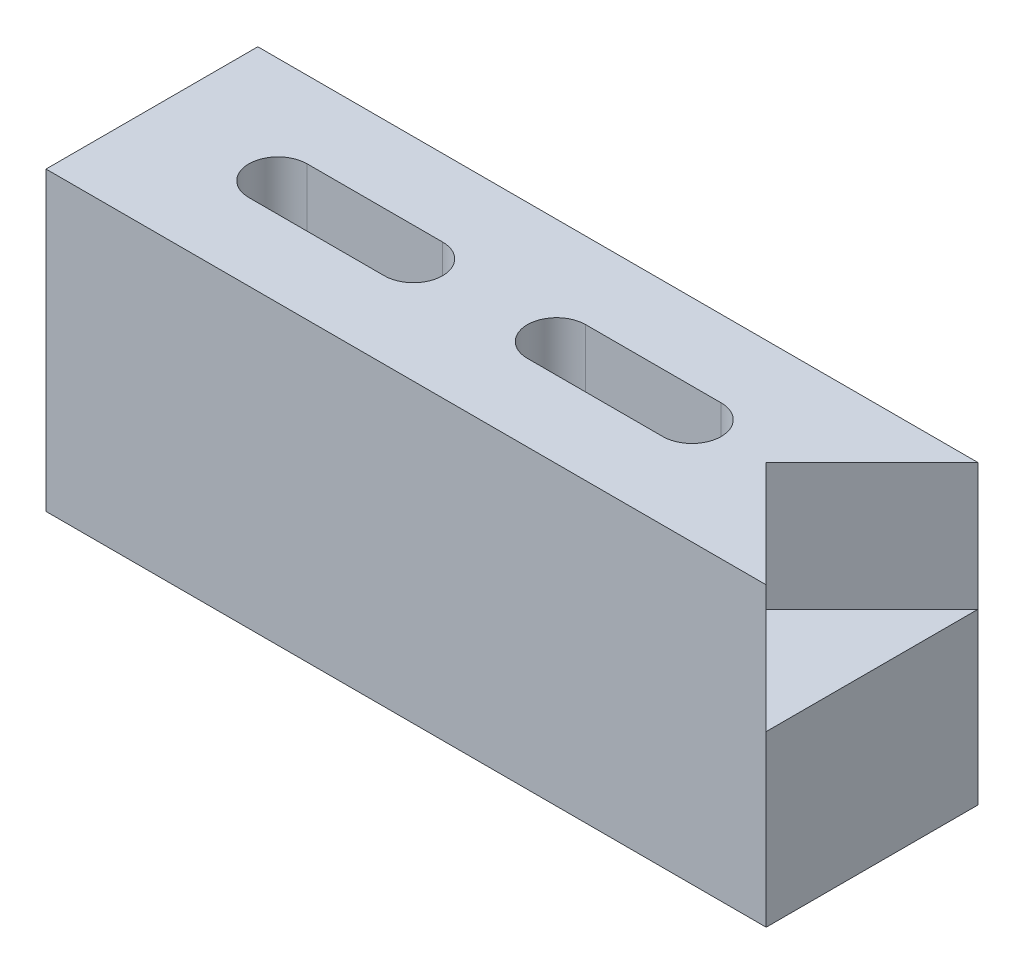
ISO-10303-21;
HEADER;
FILE_DESCRIPTION(('STEP AP214'),'2;1');
FILE_NAME('part.step','',(''),(''),'','','');
FILE_SCHEMA(('AUTOMOTIVE_DESIGN { 1 0 10303 214 1 1 1 1 }'));
ENDSEC;
DATA;
#1=APPLICATION_CONTEXT('core data for automotive mechanical design processes');
#2=APPLICATION_PROTOCOL_DEFINITION('international standard','automotive_design',2000,#1);
#3=PRODUCT_CONTEXT('',#1,'mechanical');
#4=PRODUCT('Part','Part','',(#3));
#5=PRODUCT_RELATED_PRODUCT_CATEGORY('part','',(#4));
#6=PRODUCT_DEFINITION_FORMATION('','',#4);
#7=PRODUCT_DEFINITION_CONTEXT('part definition',#1,'design');
#8=PRODUCT_DEFINITION('design','',#6,#7);
#9=PRODUCT_DEFINITION_SHAPE('','',#8);
#10=(LENGTH_UNIT() NAMED_UNIT(*) SI_UNIT(.MILLI.,.METRE.));
#11=(NAMED_UNIT(*) PLANE_ANGLE_UNIT() SI_UNIT($,.RADIAN.));
#12=(NAMED_UNIT(*) SI_UNIT($,.STERADIAN.) SOLID_ANGLE_UNIT());
#13=UNCERTAINTY_MEASURE_WITH_UNIT(LENGTH_MEASURE(1.E-05),#10,'distance_accuracy_value','');
#14=(GEOMETRIC_REPRESENTATION_CONTEXT(3) GLOBAL_UNCERTAINTY_ASSIGNED_CONTEXT((#13)) GLOBAL_UNIT_ASSIGNED_CONTEXT((#10,
#11,#12)) REPRESENTATION_CONTEXT('',''));
#15=CARTESIAN_POINT('',(0.,0.,0.));
#16=DIRECTION('',(0.,0.,1.));
#17=DIRECTION('',(1.,0.,0.));
#18=AXIS2_PLACEMENT_3D('',#15,#16,#17);
#19=CARTESIAN_POINT('',(43.18,0.,-12.7));
#20=DIRECTION('',(1.,0.,0.));
#21=DIRECTION('',(0.,0.,-1.));
#22=AXIS2_PLACEMENT_3D('',#19,#20,#21);
#23=PLANE('',#22);
#24=DIRECTION('',(0.,1.,0.));
#25=VECTOR('',#24,1.);
#26=CARTESIAN_POINT('',(43.18,0.,-12.7));
#27=LINE('',#26,#25);
#28=CARTESIAN_POINT('',(43.18,0.,-12.7));
#29=VERTEX_POINT('',#28);
#30=CARTESIAN_POINT('',(43.18,10.16,-12.7));
#31=VERTEX_POINT('',#30);
#32=EDGE_CURVE('E235',#29,#31,#27,.T.);
#33=ORIENTED_EDGE('',*,*,#32,.T.);
#34=DIRECTION('',(0.,0.,-1.));
#35=VECTOR('',#34,1.);
#36=CARTESIAN_POINT('',(43.18,10.16,-12.7));
#37=LINE('',#36,#35);
#38=CARTESIAN_POINT('',(43.18,10.16,0.));
#39=VERTEX_POINT('',#38);
#40=EDGE_CURVE('E207',#39,#31,#37,.T.);
#41=ORIENTED_EDGE('',*,*,#40,.F.);
#42=DIRECTION('',(0.,1.,0.));
#43=VECTOR('',#42,1.);
#44=CARTESIAN_POINT('',(43.18,0.,0.));
#45=LINE('',#44,#43);
#46=CARTESIAN_POINT('',(43.18,0.,0.));
#47=VERTEX_POINT('',#46);
#48=EDGE_CURVE('E246',#47,#39,#45,.T.);
#49=ORIENTED_EDGE('',*,*,#48,.F.);
#50=DIRECTION('',(0.,0.,1.));
#51=VECTOR('',#50,1.);
#52=CARTESIAN_POINT('',(43.18,0.,-12.7));
#53=LINE('',#52,#51);
#54=EDGE_CURVE('E44',#29,#47,#53,.T.);
#55=ORIENTED_EDGE('',*,*,#54,.F.);
#56=EDGE_LOOP('',(#33,#41,#49,#55));
#57=FACE_BOUND('',#56,.T.);
#58=ADVANCED_FACE('F35',(#57),#23,.T.);
#59=CARTESIAN_POINT('',(0.,0.,-12.7));
#60=DIRECTION('',(-1.,0.,0.));
#61=DIRECTION('',(0.,0.,1.));
#62=AXIS2_PLACEMENT_3D('',#59,#60,#61);
#63=PLANE('',#62);
#64=DIRECTION('',(0.,-1.,0.));
#65=VECTOR('',#64,1.);
#66=CARTESIAN_POINT('',(0.,0.,0.));
#67=LINE('',#66,#65);
#68=CARTESIAN_POINT('',(0.,17.78,0.));
#69=VERTEX_POINT('',#68);
#70=CARTESIAN_POINT('',(0.,0.,0.));
#71=VERTEX_POINT('',#70);
#72=EDGE_CURVE('E224',#69,#71,#67,.T.);
#73=ORIENTED_EDGE('',*,*,#72,.F.);
#74=DIRECTION('',(0.,0.,1.));
#75=VECTOR('',#74,1.);
#76=CARTESIAN_POINT('',(0.,17.78,-12.7));
#77=LINE('',#76,#75);
#78=CARTESIAN_POINT('',(0.,17.78,-12.7));
#79=VERTEX_POINT('',#78);
#80=EDGE_CURVE('E11',#79,#69,#77,.T.);
#81=ORIENTED_EDGE('',*,*,#80,.F.);
#82=DIRECTION('',(0.,-1.,0.));
#83=VECTOR('',#82,1.);
#84=CARTESIAN_POINT('',(0.,0.,-12.7));
#85=LINE('',#84,#83);
#86=CARTESIAN_POINT('',(0.,0.,-12.7));
#87=VERTEX_POINT('',#86);
#88=EDGE_CURVE('E228',#79,#87,#85,.T.);
#89=ORIENTED_EDGE('',*,*,#88,.T.);
#90=DIRECTION('',(0.,0.,1.));
#91=VECTOR('',#90,1.);
#92=CARTESIAN_POINT('',(0.,0.,-12.7));
#93=LINE('',#92,#91);
#94=EDGE_CURVE('E39',#87,#71,#93,.T.);
#95=ORIENTED_EDGE('',*,*,#94,.T.);
#96=EDGE_LOOP('',(#73,#81,#89,#95));
#97=FACE_BOUND('',#96,.T.);
#98=ADVANCED_FACE('F37',(#97),#63,.T.);
#99=CARTESIAN_POINT('',(0.,17.78,-12.7));
#100=DIRECTION('',(0.,1.,0.));
#101=DIRECTION('',(0.,0.,1.));
#102=AXIS2_PLACEMENT_3D('',#99,#100,#101);
#103=PLANE('',#102);
#104=CARTESIAN_POINT('',(32.381000008,17.78,-6.35));
#105=DIRECTION('',(0.,1.,0.));
#106=DIRECTION('',(0.,0.,1.));
#107=AXIS2_PLACEMENT_3D('',#104,#105,#106);
#108=CIRCLE('',#107,1.750000056);
#109=CARTESIAN_POINT('',(32.381000008,17.78,-4.599999944));
#110=VERTEX_POINT('',#109);
#111=CARTESIAN_POINT('',(32.381000008,17.78,-8.100000056));
#112=VERTEX_POINT('',#111);
#113=EDGE_CURVE('E52',#110,#112,#108,.T.);
#114=ORIENTED_EDGE('',*,*,#113,.F.);
#115=DIRECTION('',(1.,0.,0.));
#116=VECTOR('',#115,1.);
#117=CARTESIAN_POINT('',(32.381000008,17.78,-4.599999944));
#118=LINE('',#117,#116);
#119=CARTESIAN_POINT('',(24.260999992,17.78,-4.599999944));
#120=VERTEX_POINT('',#119);
#121=EDGE_CURVE('E158',#120,#110,#118,.T.);
#122=ORIENTED_EDGE('',*,*,#121,.F.);
#123=CARTESIAN_POINT('',(24.260999992,17.78,-6.35));
#124=DIRECTION('',(0.,1.,0.));
#125=DIRECTION('',(0.,0.,1.));
#126=AXIS2_PLACEMENT_3D('',#123,#124,#125);
#127=CIRCLE('',#126,1.750000056);
#128=CARTESIAN_POINT('',(24.260999992,17.78,-8.100000056));
#129=VERTEX_POINT('',#128);
#130=EDGE_CURVE('E161',#129,#120,#127,.T.);
#131=ORIENTED_EDGE('',*,*,#130,.F.);
#132=DIRECTION('',(-1.,0.,0.));
#133=VECTOR('',#132,1.);
#134=CARTESIAN_POINT('',(32.381000008,17.78,-8.100000056));
#135=LINE('',#134,#133);
#136=EDGE_CURVE('E167',#112,#129,#135,.T.);
#137=ORIENTED_EDGE('',*,*,#136,.F.);
#138=EDGE_LOOP('',(#114,#122,#131,#137));
#139=FACE_BOUND('',#138,.T.);
#140=CARTESIAN_POINT('',(15.68099988,17.78,-6.35));
#141=DIRECTION('',(0.,1.,0.));
#142=DIRECTION('',(0.,0.,1.));
#143=AXIS2_PLACEMENT_3D('',#140,#141,#142);
#144=CIRCLE('',#143,1.750000056);
#145=CARTESIAN_POINT('',(15.68099988,17.78,-4.599999944));
#146=VERTEX_POINT('',#145);
#147=CARTESIAN_POINT('',(15.68099988,17.78,-8.100000056));
#148=VERTEX_POINT('',#147);
#149=EDGE_CURVE('E60',#146,#148,#144,.T.);
#150=ORIENTED_EDGE('',*,*,#149,.F.);
#151=DIRECTION('',(1.,0.,0.));
#152=VECTOR('',#151,1.);
#153=CARTESIAN_POINT('',(15.68099988,17.78,-4.599999944));
#154=LINE('',#153,#152);
#155=CARTESIAN_POINT('',(7.56099986399997,17.78,-4.599999944));
#156=VERTEX_POINT('',#155);
#157=EDGE_CURVE('E182',#156,#146,#154,.T.);
#158=ORIENTED_EDGE('',*,*,#157,.F.);
#159=CARTESIAN_POINT('',(7.56099986399997,17.78,-6.35));
#160=DIRECTION('',(0.,1.,0.));
#161=DIRECTION('',(0.,0.,1.));
#162=AXIS2_PLACEMENT_3D('',#159,#160,#161);
#163=CIRCLE('',#162,1.750000056);
#164=CARTESIAN_POINT('',(7.56099986399997,17.78,-8.100000056));
#165=VERTEX_POINT('',#164);
#166=EDGE_CURVE('E196',#165,#156,#163,.T.);
#167=ORIENTED_EDGE('',*,*,#166,.F.);
#168=DIRECTION('',(-1.,0.,0.));
#169=VECTOR('',#168,1.);
#170=CARTESIAN_POINT('',(15.68099988,17.78,-8.100000056));
#171=LINE('',#170,#169);
#172=EDGE_CURVE('E193',#148,#165,#171,.T.);
#173=ORIENTED_EDGE('',*,*,#172,.F.);
#174=EDGE_LOOP('',(#150,#158,#167,#173));
#175=FACE_BOUND('',#174,.T.);
#176=DIRECTION('',(0.707106781186549,0.,0.707106781186546));
#177=VECTOR('',#176,1.);
#178=CARTESIAN_POINT('',(36.83,17.78,-6.35));
#179=LINE('',#178,#177);
#180=CARTESIAN_POINT('',(36.83,17.78,-6.35));
#181=VERTEX_POINT('',#180);
#182=CARTESIAN_POINT('',(43.18,17.78,0.));
#183=VERTEX_POINT('',#182);
#184=EDGE_CURVE('E211',#181,#183,#179,.T.);
#185=ORIENTED_EDGE('',*,*,#184,.F.);
#186=DIRECTION('',(-0.707106781186549,0.,0.707106781186546));
#187=VECTOR('',#186,1.);
#188=CARTESIAN_POINT('',(43.18,17.78,-12.7));
#189=LINE('',#188,#187);
#190=CARTESIAN_POINT('',(43.18,17.78,-12.7));
#191=VERTEX_POINT('',#190);
#192=EDGE_CURVE('E174',#191,#181,#189,.T.);
#193=ORIENTED_EDGE('',*,*,#192,.F.);
#194=DIRECTION('',(-1.,0.,0.));
#195=VECTOR('',#194,1.);
#196=CARTESIAN_POINT('',(0.,17.78,-12.7));
#197=LINE('',#196,#195);
#198=EDGE_CURVE('E238',#191,#79,#197,.T.);
#199=ORIENTED_EDGE('',*,*,#198,.T.);
#200=ORIENTED_EDGE('',*,*,#80,.T.);
#201=DIRECTION('',(-1.,0.,0.));
#202=VECTOR('',#201,1.);
#203=CARTESIAN_POINT('',(0.,17.78,0.));
#204=LINE('',#203,#202);
#205=EDGE_CURVE('E232',#183,#69,#204,.T.);
#206=ORIENTED_EDGE('',*,*,#205,.F.);
#207=EDGE_LOOP('',(#185,#193,#199,#200,#206));
#208=FACE_BOUND('',#207,.T.);
#209=ADVANCED_FACE('F262',(#139,#175,#208),#103,.T.);
#210=CARTESIAN_POINT('',(0.,0.,-12.7));
#211=DIRECTION('',(0.,-1.,0.));
#212=DIRECTION('',(0.,0.,-1.));
#213=AXIS2_PLACEMENT_3D('',#210,#211,#212);
#214=PLANE('',#213);
#215=CARTESIAN_POINT('',(32.381000008,0.,-6.35));
#216=DIRECTION('',(0.,1.,0.));
#217=DIRECTION('',(0.,0.,1.));
#218=AXIS2_PLACEMENT_3D('',#215,#216,#217);
#219=CIRCLE('',#218,1.750000056);
#220=CARTESIAN_POINT('',(32.381000008,0.,-4.599999944));
#221=VERTEX_POINT('',#220);
#222=CARTESIAN_POINT('',(32.381000008,0.,-8.100000056));
#223=VERTEX_POINT('',#222);
#224=EDGE_CURVE('E139',#221,#223,#219,.T.);
#225=ORIENTED_EDGE('',*,*,#224,.T.);
#226=DIRECTION('',(-1.,0.,0.));
#227=VECTOR('',#226,1.);
#228=CARTESIAN_POINT('',(32.381000008,0.,-8.100000056));
#229=LINE('',#228,#227);
#230=CARTESIAN_POINT('',(24.260999992,0.,-8.100000056));
#231=VERTEX_POINT('',#230);
#232=EDGE_CURVE('E149',#223,#231,#229,.T.);
#233=ORIENTED_EDGE('',*,*,#232,.T.);
#234=CARTESIAN_POINT('',(24.260999992,0.,-6.35));
#235=DIRECTION('',(0.,1.,0.));
#236=DIRECTION('',(0.,0.,1.));
#237=AXIS2_PLACEMENT_3D('',#234,#235,#236);
#238=CIRCLE('',#237,1.750000056);
#239=CARTESIAN_POINT('',(24.260999992,0.,-4.599999944));
#240=VERTEX_POINT('',#239);
#241=EDGE_CURVE('E153',#231,#240,#238,.T.);
#242=ORIENTED_EDGE('',*,*,#241,.T.);
#243=DIRECTION('',(1.,0.,0.));
#244=VECTOR('',#243,1.);
#245=CARTESIAN_POINT('',(32.381000008,0.,-4.599999944));
#246=LINE('',#245,#244);
#247=EDGE_CURVE('E145',#240,#221,#246,.T.);
#248=ORIENTED_EDGE('',*,*,#247,.T.);
#249=EDGE_LOOP('',(#225,#233,#242,#248));
#250=FACE_BOUND('',#249,.T.);
#251=CARTESIAN_POINT('',(15.68099988,0.,-6.35));
#252=DIRECTION('',(0.,1.,0.));
#253=DIRECTION('',(0.,0.,1.));
#254=AXIS2_PLACEMENT_3D('',#251,#252,#253);
#255=CIRCLE('',#254,1.750000056);
#256=CARTESIAN_POINT('',(15.68099988,0.,-4.599999944));
#257=VERTEX_POINT('',#256);
#258=CARTESIAN_POINT('',(15.68099988,0.,-8.100000056));
#259=VERTEX_POINT('',#258);
#260=EDGE_CURVE('E178',#257,#259,#255,.T.);
#261=ORIENTED_EDGE('',*,*,#260,.T.);
#262=DIRECTION('',(-1.,0.,0.));
#263=VECTOR('',#262,1.);
#264=CARTESIAN_POINT('',(15.68099988,0.,-8.100000056));
#265=LINE('',#264,#263);
#266=CARTESIAN_POINT('',(7.56099986399997,0.,-8.100000056));
#267=VERTEX_POINT('',#266);
#268=EDGE_CURVE('E181',#259,#267,#265,.T.);
#269=ORIENTED_EDGE('',*,*,#268,.T.);
#270=CARTESIAN_POINT('',(7.56099986399997,0.,-6.35));
#271=DIRECTION('',(0.,1.,0.));
#272=DIRECTION('',(0.,0.,1.));
#273=AXIS2_PLACEMENT_3D('',#270,#271,#272);
#274=CIRCLE('',#273,1.750000056);
#275=CARTESIAN_POINT('',(7.56099986399997,0.,-4.599999944));
#276=VERTEX_POINT('',#275);
#277=EDGE_CURVE('E185',#267,#276,#274,.T.);
#278=ORIENTED_EDGE('',*,*,#277,.T.);
#279=DIRECTION('',(1.,0.,0.));
#280=VECTOR('',#279,1.);
#281=CARTESIAN_POINT('',(15.68099988,0.,-4.599999944));
#282=LINE('',#281,#280);
#283=EDGE_CURVE('E188',#276,#257,#282,.T.);
#284=ORIENTED_EDGE('',*,*,#283,.T.);
#285=EDGE_LOOP('',(#261,#269,#278,#284));
#286=FACE_BOUND('',#285,.T.);
#287=DIRECTION('',(1.,0.,0.));
#288=VECTOR('',#287,1.);
#289=CARTESIAN_POINT('',(0.,0.,0.));
#290=LINE('',#289,#288);
#291=EDGE_CURVE('E243',#71,#47,#290,.T.);
#292=ORIENTED_EDGE('',*,*,#291,.F.);
#293=ORIENTED_EDGE('',*,*,#94,.F.);
#294=DIRECTION('',(1.,0.,0.));
#295=VECTOR('',#294,1.);
#296=CARTESIAN_POINT('',(0.,0.,-12.7));
#297=LINE('',#296,#295);
#298=EDGE_CURVE('E231',#87,#29,#297,.T.);
#299=ORIENTED_EDGE('',*,*,#298,.T.);
#300=ORIENTED_EDGE('',*,*,#54,.T.);
#301=EDGE_LOOP('',(#292,#293,#299,#300));
#302=FACE_BOUND('',#301,.T.);
#303=ADVANCED_FACE('F155',(#250,#286,#302),#214,.T.);
#304=CARTESIAN_POINT('',(0.,0.,-12.7));
#305=DIRECTION('',(0.,0.,-1.));
#306=DIRECTION('',(-1.,0.,0.));
#307=AXIS2_PLACEMENT_3D('',#304,#305,#306);
#308=PLANE('',#307);
#309=ORIENTED_EDGE('',*,*,#88,.F.);
#310=ORIENTED_EDGE('',*,*,#198,.F.);
#311=DIRECTION('',(0.,1.,0.));
#312=VECTOR('',#311,1.);
#313=CARTESIAN_POINT('',(43.18,10.16,-12.7));
#314=LINE('',#313,#312);
#315=EDGE_CURVE('E217',#31,#191,#314,.T.);
#316=ORIENTED_EDGE('',*,*,#315,.F.);
#317=ORIENTED_EDGE('',*,*,#32,.F.);
#318=ORIENTED_EDGE('',*,*,#298,.F.);
#319=EDGE_LOOP('',(#309,#310,#316,#317,#318));
#320=FACE_BOUND('',#319,.T.);
#321=ADVANCED_FACE('F266',(#320),#308,.T.);
#322=CARTESIAN_POINT('',(0.,0.,0.));
#323=DIRECTION('',(0.,0.,-1.));
#324=DIRECTION('',(-1.,0.,0.));
#325=AXIS2_PLACEMENT_3D('',#322,#323,#324);
#326=PLANE('',#325);
#327=ORIENTED_EDGE('',*,*,#72,.T.);
#328=ORIENTED_EDGE('',*,*,#291,.T.);
#329=ORIENTED_EDGE('',*,*,#48,.T.);
#330=DIRECTION('',(0.,1.,0.));
#331=VECTOR('',#330,1.);
#332=CARTESIAN_POINT('',(43.18,10.16,0.));
#333=LINE('',#332,#331);
#334=EDGE_CURVE('E221',#39,#183,#333,.T.);
#335=ORIENTED_EDGE('',*,*,#334,.T.);
#336=ORIENTED_EDGE('',*,*,#205,.T.);
#337=EDGE_LOOP('',(#327,#328,#329,#335,#336));
#338=FACE_BOUND('',#337,.T.);
#339=ADVANCED_FACE('F258',(#338),#326,.F.);
#340=CARTESIAN_POINT('',(36.83,10.16,-6.35));
#341=DIRECTION('',(-0.707106781186546,0.,0.707106781186549));
#342=DIRECTION('',(0.707106781186549,0.,0.707106781186546));
#343=AXIS2_PLACEMENT_3D('',#340,#341,#342);
#344=PLANE('',#343);
#345=ORIENTED_EDGE('',*,*,#184,.T.);
#346=ORIENTED_EDGE('',*,*,#334,.F.);
#347=DIRECTION('',(0.707106781186549,0.,0.707106781186546));
#348=VECTOR('',#347,1.);
#349=CARTESIAN_POINT('',(36.83,10.16,-6.35));
#350=LINE('',#349,#348);
#351=CARTESIAN_POINT('',(36.83,10.16,-6.35));
#352=VERTEX_POINT('',#351);
#353=EDGE_CURVE('E214',#352,#39,#350,.T.);
#354=ORIENTED_EDGE('',*,*,#353,.F.);
#355=DIRECTION('',(0.,1.,0.));
#356=VECTOR('',#355,1.);
#357=CARTESIAN_POINT('',(36.83,10.16,-6.35));
#358=LINE('',#357,#356);
#359=EDGE_CURVE('E225',#352,#181,#358,.T.);
#360=ORIENTED_EDGE('',*,*,#359,.T.);
#361=EDGE_LOOP('',(#345,#346,#354,#360));
#362=FACE_BOUND('',#361,.T.);
#363=ADVANCED_FACE('F275',(#362),#344,.F.);
#364=CARTESIAN_POINT('',(43.18,10.16,-12.7));
#365=DIRECTION('',(-0.707106781186546,0.,-0.707106781186549));
#366=DIRECTION('',(-0.707106781186549,0.,0.707106781186546));
#367=AXIS2_PLACEMENT_3D('',#364,#365,#366);
#368=PLANE('',#367);
#369=ORIENTED_EDGE('',*,*,#192,.T.);
#370=ORIENTED_EDGE('',*,*,#359,.F.);
#371=DIRECTION('',(-0.707106781186549,0.,0.707106781186546));
#372=VECTOR('',#371,1.);
#373=CARTESIAN_POINT('',(43.18,10.16,-12.7));
#374=LINE('',#373,#372);
#375=EDGE_CURVE('E210',#31,#352,#374,.T.);
#376=ORIENTED_EDGE('',*,*,#375,.F.);
#377=ORIENTED_EDGE('',*,*,#315,.T.);
#378=EDGE_LOOP('',(#369,#370,#376,#377));
#379=FACE_BOUND('',#378,.T.);
#380=ADVANCED_FACE('F277',(#379),#368,.F.);
#381=CARTESIAN_POINT('',(0.,10.16,0.));
#382=DIRECTION('',(0.,1.,0.));
#383=DIRECTION('',(-1.,0.,0.));
#384=AXIS2_PLACEMENT_3D('',#381,#382,#383);
#385=PLANE('',#384);
#386=ORIENTED_EDGE('',*,*,#40,.T.);
#387=ORIENTED_EDGE('',*,*,#375,.T.);
#388=ORIENTED_EDGE('',*,*,#353,.T.);
#389=EDGE_LOOP('',(#386,#387,#388));
#390=FACE_BOUND('',#389,.T.);
#391=ADVANCED_FACE('F272',(#390),#385,.T.);
#392=CARTESIAN_POINT('',(15.68099988,0.,-6.35));
#393=DIRECTION('',(0.,1.,0.));
#394=DIRECTION('',(0.,0.,1.));
#395=AXIS2_PLACEMENT_3D('',#392,#393,#394);
#396=CYLINDRICAL_SURFACE('',#395,1.750000056);
#397=ORIENTED_EDGE('',*,*,#149,.T.);
#398=DIRECTION('',(0.,1.,0.));
#399=VECTOR('',#398,1.);
#400=CARTESIAN_POINT('',(15.68099988,0.,-8.100000056));
#401=LINE('',#400,#399);
#402=EDGE_CURVE('E191',#259,#148,#401,.T.);
#403=ORIENTED_EDGE('',*,*,#402,.F.);
#404=ORIENTED_EDGE('',*,*,#260,.F.);
#405=DIRECTION('',(0.,1.,0.));
#406=VECTOR('',#405,1.);
#407=CARTESIAN_POINT('',(15.68099988,0.,-4.599999944));
#408=LINE('',#407,#406);
#409=EDGE_CURVE('E168',#257,#146,#408,.T.);
#410=ORIENTED_EDGE('',*,*,#409,.T.);
#411=EDGE_LOOP('',(#397,#403,#404,#410));
#412=FACE_BOUND('',#411,.T.);
#413=ADVANCED_FACE('F284',(#412),#396,.F.);
#414=CARTESIAN_POINT('',(15.68099988,0.,-4.599999944));
#415=DIRECTION('',(0.,0.,1.));
#416=DIRECTION('',(1.,0.,0.));
#417=AXIS2_PLACEMENT_3D('',#414,#415,#416);
#418=PLANE('',#417);
#419=ORIENTED_EDGE('',*,*,#157,.T.);
#420=ORIENTED_EDGE('',*,*,#409,.F.);
#421=ORIENTED_EDGE('',*,*,#283,.F.);
#422=DIRECTION('',(0.,1.,0.));
#423=VECTOR('',#422,1.);
#424=CARTESIAN_POINT('',(7.56099986399997,0.,-4.599999944));
#425=LINE('',#424,#423);
#426=EDGE_CURVE('E202',#276,#156,#425,.T.);
#427=ORIENTED_EDGE('',*,*,#426,.T.);
#428=EDGE_LOOP('',(#419,#420,#421,#427));
#429=FACE_BOUND('',#428,.T.);
#430=ADVANCED_FACE('F315',(#429),#418,.F.);
#431=CARTESIAN_POINT('',(7.56099986399997,0.,-6.35));
#432=DIRECTION('',(0.,1.,0.));
#433=DIRECTION('',(0.,0.,1.));
#434=AXIS2_PLACEMENT_3D('',#431,#432,#433);
#435=CYLINDRICAL_SURFACE('',#434,1.750000056);
#436=ORIENTED_EDGE('',*,*,#166,.T.);
#437=ORIENTED_EDGE('',*,*,#426,.F.);
#438=ORIENTED_EDGE('',*,*,#277,.F.);
#439=DIRECTION('',(0.,1.,0.));
#440=VECTOR('',#439,1.);
#441=CARTESIAN_POINT('',(7.56099986399997,0.,-8.100000056));
#442=LINE('',#441,#440);
#443=EDGE_CURVE('E204',#267,#165,#442,.T.);
#444=ORIENTED_EDGE('',*,*,#443,.T.);
#445=EDGE_LOOP('',(#436,#437,#438,#444));
#446=FACE_BOUND('',#445,.T.);
#447=ADVANCED_FACE('F317',(#446),#435,.F.);
#448=CARTESIAN_POINT('',(15.68099988,0.,-8.100000056));
#449=DIRECTION('',(0.,0.,-1.));
#450=DIRECTION('',(-1.,0.,0.));
#451=AXIS2_PLACEMENT_3D('',#448,#449,#450);
#452=PLANE('',#451);
#453=ORIENTED_EDGE('',*,*,#172,.T.);
#454=ORIENTED_EDGE('',*,*,#443,.F.);
#455=ORIENTED_EDGE('',*,*,#268,.F.);
#456=ORIENTED_EDGE('',*,*,#402,.T.);
#457=EDGE_LOOP('',(#453,#454,#455,#456));
#458=FACE_BOUND('',#457,.T.);
#459=ADVANCED_FACE('F310',(#458),#452,.F.);
#460=CARTESIAN_POINT('',(32.381000008,0.,-6.35));
#461=DIRECTION('',(0.,1.,0.));
#462=DIRECTION('',(0.,0.,1.));
#463=AXIS2_PLACEMENT_3D('',#460,#461,#462);
#464=CYLINDRICAL_SURFACE('',#463,1.750000056);
#465=ORIENTED_EDGE('',*,*,#113,.T.);
#466=DIRECTION('',(0.,1.,0.));
#467=VECTOR('',#466,1.);
#468=CARTESIAN_POINT('',(32.381000008,0.,-8.100000056));
#469=LINE('',#468,#467);
#470=EDGE_CURVE('E135',#223,#112,#469,.T.);
#471=ORIENTED_EDGE('',*,*,#470,.F.);
#472=ORIENTED_EDGE('',*,*,#224,.F.);
#473=DIRECTION('',(0.,1.,0.));
#474=VECTOR('',#473,1.);
#475=CARTESIAN_POINT('',(32.381000008,0.,-4.599999944));
#476=LINE('',#475,#474);
#477=EDGE_CURVE('E172',#221,#110,#476,.T.);
#478=ORIENTED_EDGE('',*,*,#477,.T.);
#479=EDGE_LOOP('',(#465,#471,#472,#478));
#480=FACE_BOUND('',#479,.T.);
#481=ADVANCED_FACE('F137',(#480),#464,.F.);
#482=CARTESIAN_POINT('',(32.381000008,0.,-4.599999944));
#483=DIRECTION('',(0.,0.,1.));
#484=DIRECTION('',(1.,0.,0.));
#485=AXIS2_PLACEMENT_3D('',#482,#483,#484);
#486=PLANE('',#485);
#487=ORIENTED_EDGE('',*,*,#121,.T.);
#488=ORIENTED_EDGE('',*,*,#477,.F.);
#489=ORIENTED_EDGE('',*,*,#247,.F.);
#490=DIRECTION('',(0.,1.,0.));
#491=VECTOR('',#490,1.);
#492=CARTESIAN_POINT('',(24.260999992,0.,-4.599999944));
#493=LINE('',#492,#491);
#494=EDGE_CURVE('E175',#240,#120,#493,.T.);
#495=ORIENTED_EDGE('',*,*,#494,.T.);
#496=EDGE_LOOP('',(#487,#488,#489,#495));
#497=FACE_BOUND('',#496,.T.);
#498=ADVANCED_FACE('F356',(#497),#486,.F.);
#499=CARTESIAN_POINT('',(24.260999992,0.,-6.35));
#500=DIRECTION('',(0.,1.,0.));
#501=DIRECTION('',(0.,0.,1.));
#502=AXIS2_PLACEMENT_3D('',#499,#500,#501);
#503=CYLINDRICAL_SURFACE('',#502,1.750000056);
#504=ORIENTED_EDGE('',*,*,#130,.T.);
#505=ORIENTED_EDGE('',*,*,#494,.F.);
#506=ORIENTED_EDGE('',*,*,#241,.F.);
#507=DIRECTION('',(0.,1.,0.));
#508=VECTOR('',#507,1.);
#509=CARTESIAN_POINT('',(24.260999992,0.,-8.100000056));
#510=LINE('',#509,#508);
#511=EDGE_CURVE('E144',#231,#129,#510,.T.);
#512=ORIENTED_EDGE('',*,*,#511,.T.);
#513=EDGE_LOOP('',(#504,#505,#506,#512));
#514=FACE_BOUND('',#513,.T.);
#515=ADVANCED_FACE('F364',(#514),#503,.F.);
#516=CARTESIAN_POINT('',(32.381000008,0.,-8.100000056));
#517=DIRECTION('',(0.,0.,-1.));
#518=DIRECTION('',(-1.,0.,0.));
#519=AXIS2_PLACEMENT_3D('',#516,#517,#518);
#520=PLANE('',#519);
#521=ORIENTED_EDGE('',*,*,#136,.T.);
#522=ORIENTED_EDGE('',*,*,#511,.F.);
#523=ORIENTED_EDGE('',*,*,#232,.F.);
#524=ORIENTED_EDGE('',*,*,#470,.T.);
#525=EDGE_LOOP('',(#521,#522,#523,#524));
#526=FACE_BOUND('',#525,.T.);
#527=ADVANCED_FACE('F150',(#526),#520,.F.);
#528=CLOSED_SHELL('',(#58,#98,#209,#303,#321,#339,#363,#380,#391,#413,#430,#447,#459,#481,#498,
#515,#527));
#529=MANIFOLD_SOLID_BREP('B2',#528);
#530=ADVANCED_BREP_SHAPE_REPRESENTATION('',(#18,#529),#14);
#531=SHAPE_DEFINITION_REPRESENTATION(#9,#530);
ENDSEC;
END-ISO-10303-21;
